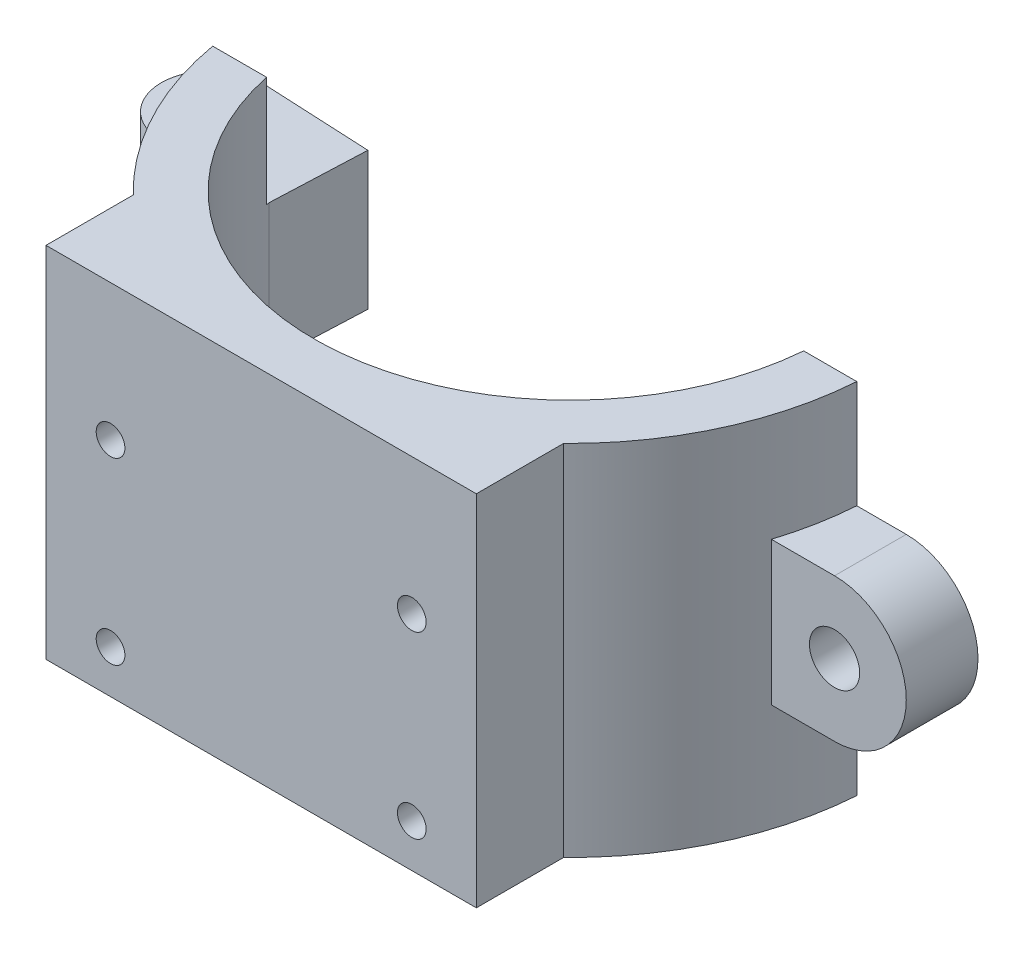
ISO-10303-21;
HEADER;
FILE_DESCRIPTION(('STEP AP214'),'2;1');
FILE_NAME('part.step','',(''),(''),'','','');
FILE_SCHEMA(('AUTOMOTIVE_DESIGN { 1 0 10303 214 1 1 1 1 }'));
ENDSEC;
DATA;
#1=APPLICATION_CONTEXT('core data for automotive mechanical design processes');
#2=APPLICATION_PROTOCOL_DEFINITION('international standard','automotive_design',2000,#1);
#3=PRODUCT_CONTEXT('',#1,'mechanical');
#4=PRODUCT('Part','Part','',(#3));
#5=PRODUCT_RELATED_PRODUCT_CATEGORY('part','',(#4));
#6=PRODUCT_DEFINITION_FORMATION('','',#4);
#7=PRODUCT_DEFINITION_CONTEXT('part definition',#1,'design');
#8=PRODUCT_DEFINITION('design','',#6,#7);
#9=PRODUCT_DEFINITION_SHAPE('','',#8);
#10=(LENGTH_UNIT() NAMED_UNIT(*) SI_UNIT(.MILLI.,.METRE.));
#11=(NAMED_UNIT(*) PLANE_ANGLE_UNIT() SI_UNIT($,.RADIAN.));
#12=(NAMED_UNIT(*) SI_UNIT($,.STERADIAN.) SOLID_ANGLE_UNIT());
#13=UNCERTAINTY_MEASURE_WITH_UNIT(LENGTH_MEASURE(1.E-05),#10,'distance_accuracy_value','');
#14=(GEOMETRIC_REPRESENTATION_CONTEXT(3) GLOBAL_UNCERTAINTY_ASSIGNED_CONTEXT((#13)) GLOBAL_UNIT_ASSIGNED_CONTEXT((#10,
#11,#12)) REPRESENTATION_CONTEXT('',''));
#15=CARTESIAN_POINT('',(0.,0.,0.));
#16=DIRECTION('',(0.,0.,1.));
#17=DIRECTION('',(1.,0.,0.));
#18=AXIS2_PLACEMENT_3D('',#15,#16,#17);
#19=CARTESIAN_POINT('',(0.,-72.1979747624781,1.5));
#20=DIRECTION('',(0.,1.,0.));
#21=DIRECTION('',(0.,0.,1.));
#22=AXIS2_PLACEMENT_3D('',#19,#20,#21);
#23=CYLINDRICAL_SURFACE('',#22,21.5363065542818);
#24=DIRECTION('',(0.,1.,0.));
#25=VECTOR('',#24,1.);
#26=CARTESIAN_POINT('',(15.,-72.1979747624781,16.9535594605256));
#27=LINE('',#26,#25);
#28=CARTESIAN_POINT('',(15.,-25.,16.9535594605256));
#29=VERTEX_POINT('',#28);
#30=CARTESIAN_POINT('',(15.,0.,16.9535594605256));
#31=VERTEX_POINT('',#30);
#32=EDGE_CURVE('E202',#29,#31,#27,.T.);
#33=ORIENTED_EDGE('',*,*,#32,.F.);
#34=CARTESIAN_POINT('',(0.,-25.,1.5));
#35=DIRECTION('',(0.,1.,0.));
#36=DIRECTION('',(0.,0.,1.));
#37=AXIS2_PLACEMENT_3D('',#34,#35,#36);
#38=CIRCLE('',#37,21.5363065542818);
#39=CARTESIAN_POINT('',(21.4840056786438,-25.,2.99999999999998));
#40=VERTEX_POINT('',#39);
#41=EDGE_CURVE('E286',#40,#29,#38,.F.);
#42=ORIENTED_EDGE('',*,*,#41,.F.);
#43=DIRECTION('',(0.,1.,0.));
#44=VECTOR('',#43,1.);
#45=CARTESIAN_POINT('',(21.4840056786438,-72.1979747624781,2.99999999999998));
#46=LINE('',#45,#44);
#47=CARTESIAN_POINT('',(21.4840056786438,-17.5,2.99999999999998));
#48=VERTEX_POINT('',#47);
#49=EDGE_CURVE('E304',#40,#48,#46,.T.);
#50=ORIENTED_EDGE('',*,*,#49,.T.);
#51=CARTESIAN_POINT('',(0.,-17.5,1.5));
#52=DIRECTION('',(0.,-1.,0.));
#53=DIRECTION('',(0.,0.,-1.));
#54=AXIS2_PLACEMENT_3D('',#51,#52,#53);
#55=CIRCLE('',#54,21.5363065542818);
#56=CARTESIAN_POINT('',(20.5319872394272,-17.5,7.99999999999999));
#57=VERTEX_POINT('',#56);
#58=EDGE_CURVE('E316',#57,#48,#55,.F.);
#59=ORIENTED_EDGE('',*,*,#58,.F.);
#60=DIRECTION('',(0.,1.,0.));
#61=VECTOR('',#60,1.);
#62=CARTESIAN_POINT('',(20.5319872394272,-72.1979747624781,7.99999999999999));
#63=LINE('',#62,#61);
#64=CARTESIAN_POINT('',(20.5319872394272,-7.50000000000001,7.99999999999999));
#65=VERTEX_POINT('',#64);
#66=EDGE_CURVE('E294',#65,#57,#63,.F.);
#67=ORIENTED_EDGE('',*,*,#66,.F.);
#68=CARTESIAN_POINT('',(0.,-7.50000000000001,1.5));
#69=DIRECTION('',(0.,1.,0.));
#70=DIRECTION('',(-1.,0.,0.));
#71=AXIS2_PLACEMENT_3D('',#68,#69,#70);
#72=CIRCLE('',#71,21.5363065542818);
#73=CARTESIAN_POINT('',(21.4840056786438,-7.5,2.99999999999999));
#74=VERTEX_POINT('',#73);
#75=EDGE_CURVE('E313',#74,#65,#72,.F.);
#76=ORIENTED_EDGE('',*,*,#75,.F.);
#77=CARTESIAN_POINT('',(21.4840056786438,0.,2.99999999999998));
#78=VERTEX_POINT('',#77);
#79=EDGE_CURVE('E306',#74,#78,#46,.T.);
#80=ORIENTED_EDGE('',*,*,#79,.T.);
#81=CARTESIAN_POINT('',(0.,0.,1.5));
#82=DIRECTION('',(0.,1.,0.));
#83=DIRECTION('',(0.,0.,1.));
#84=AXIS2_PLACEMENT_3D('',#81,#82,#83);
#85=CIRCLE('',#84,21.5363065542818);
#86=EDGE_CURVE('E296',#31,#78,#85,.T.);
#87=ORIENTED_EDGE('',*,*,#86,.F.);
#88=EDGE_LOOP('',(#33,#42,#50,#59,#67,#76,#80,#87));
#89=FACE_BOUND('',#88,.T.);
#90=ADVANCED_FACE('F33',(#89),#23,.T.);
#91=CARTESIAN_POINT('',(0.,-72.1979747624781,1.5));
#92=DIRECTION('',(0.,1.,0.));
#93=DIRECTION('',(0.,0.,1.));
#94=AXIS2_PLACEMENT_3D('',#91,#92,#93);
#95=CYLINDRICAL_SURFACE('',#94,17.8465682975747);
#96=DIRECTION('',(0.,1.,0.));
#97=VECTOR('',#96,1.);
#98=CARTESIAN_POINT('',(-17.4588086649691,-72.1979747624781,5.20000000000001));
#99=LINE('',#98,#97);
#100=CARTESIAN_POINT('',(-17.4588086649691,0.,5.20000000000001));
#101=VERTEX_POINT('',#100);
#102=CARTESIAN_POINT('',(-17.4588086649691,-7.7,5.20000000000001));
#103=VERTEX_POINT('',#102);
#104=EDGE_CURVE('E222',#101,#103,#99,.F.);
#105=ORIENTED_EDGE('',*,*,#104,.F.);
#106=CARTESIAN_POINT('',(0.,0.,1.5));
#107=DIRECTION('',(0.,-1.,0.));
#108=DIRECTION('',(0.,0.,1.));
#109=AXIS2_PLACEMENT_3D('',#106,#107,#108);
#110=CIRCLE('',#109,17.8465682975747);
#111=CARTESIAN_POINT('',(17.7834192437787,0.,2.99999999999999));
#112=VERTEX_POINT('',#111);
#113=EDGE_CURVE('E285',#112,#101,#110,.T.);
#114=ORIENTED_EDGE('',*,*,#113,.F.);
#115=DIRECTION('',(0.,1.,0.));
#116=VECTOR('',#115,1.);
#117=CARTESIAN_POINT('',(17.7834192437787,-72.1979747624781,2.99999999999999));
#118=LINE('',#117,#116);
#119=CARTESIAN_POINT('',(17.7834192437787,-25.,2.99999999999999));
#120=VERTEX_POINT('',#119);
#121=EDGE_CURVE('E302',#120,#112,#118,.T.);
#122=ORIENTED_EDGE('',*,*,#121,.F.);
#123=CARTESIAN_POINT('',(0.,-25.,1.5));
#124=DIRECTION('',(0.,1.,0.));
#125=DIRECTION('',(0.,0.,1.));
#126=AXIS2_PLACEMENT_3D('',#123,#124,#125);
#127=CIRCLE('',#126,17.8465682975747);
#128=CARTESIAN_POINT('',(-17.4588086649691,-25.,5.20000000000001));
#129=VERTEX_POINT('',#128);
#130=EDGE_CURVE('E292',#129,#120,#127,.T.);
#131=ORIENTED_EDGE('',*,*,#130,.F.);
#132=DIRECTION('',(0.,1.,0.));
#133=VECTOR('',#132,1.);
#134=CARTESIAN_POINT('',(-17.4588086649691,-72.1979747624781,5.20000000000001));
#135=LINE('',#134,#133);
#136=CARTESIAN_POINT('',(-17.4588086649691,-17.3,5.20000000000001));
#137=VERTEX_POINT('',#136);
#138=EDGE_CURVE('E48',#137,#129,#135,.F.);
#139=ORIENTED_EDGE('',*,*,#138,.F.);
#140=CARTESIAN_POINT('',(0.,-17.3,1.5));
#141=DIRECTION('',(0.,1.,0.));
#142=DIRECTION('',(0.,0.,1.));
#143=AXIS2_PLACEMENT_3D('',#140,#141,#142);
#144=CIRCLE('',#143,17.8465682975747);
#145=CARTESIAN_POINT('',(-17.5,-17.3,5.00000000000001));
#146=VERTEX_POINT('',#145);
#147=EDGE_CURVE('E207',#146,#137,#144,.T.);
#148=ORIENTED_EDGE('',*,*,#147,.F.);
#149=DIRECTION('',(0.,-1.,0.));
#150=VECTOR('',#149,1.);
#151=CARTESIAN_POINT('',(-17.5,-7.7,5.00000000000001));
#152=LINE('',#151,#150);
#153=CARTESIAN_POINT('',(-17.5,-7.7,5.00000000000001));
#154=VERTEX_POINT('',#153);
#155=EDGE_CURVE('E273',#154,#146,#152,.T.);
#156=ORIENTED_EDGE('',*,*,#155,.F.);
#157=CARTESIAN_POINT('',(0.,-7.7,1.5));
#158=DIRECTION('',(0.,-1.,0.));
#159=DIRECTION('',(0.,0.,-1.));
#160=AXIS2_PLACEMENT_3D('',#157,#158,#159);
#161=CIRCLE('',#160,17.8465682975747);
#162=EDGE_CURVE('E219',#103,#154,#161,.T.);
#163=ORIENTED_EDGE('',*,*,#162,.F.);
#164=EDGE_LOOP('',(#105,#114,#122,#131,#139,#148,#156,#163));
#165=FACE_BOUND('',#164,.T.);
#166=ADVANCED_FACE('F35',(#165),#95,.F.);
#167=CARTESIAN_POINT('',(17.7834192437787,-72.1979747624781,2.99999999999999));
#168=DIRECTION('',(0.,0.,-1.));
#169=DIRECTION('',(-1.,0.,0.));
#170=AXIS2_PLACEMENT_3D('',#167,#168,#169);
#171=PLANE('',#170);
#172=ORIENTED_EDGE('',*,*,#79,.F.);
#173=DIRECTION('',(1.,0.,0.));
#174=VECTOR('',#173,1.);
#175=CARTESIAN_POINT('',(17.7834192437787,-7.5,2.99999999999999));
#176=LINE('',#175,#174);
#177=CARTESIAN_POINT('',(24.9355957741627,-7.5,2.99999999999999));
#178=VERTEX_POINT('',#177);
#179=EDGE_CURVE('E228',#74,#178,#176,.T.);
#180=ORIENTED_EDGE('',*,*,#179,.T.);
#181=CARTESIAN_POINT('',(24.9355957741627,-12.5,2.99999999999999));
#182=DIRECTION('',(0.,0.,-1.));
#183=DIRECTION('',(1.,0.,0.));
#184=AXIS2_PLACEMENT_3D('',#181,#182,#183);
#185=CIRCLE('',#184,5.);
#186=CARTESIAN_POINT('',(24.9355957741627,-17.5,2.99999999999999));
#187=VERTEX_POINT('',#186);
#188=EDGE_CURVE('E242',#178,#187,#185,.T.);
#189=ORIENTED_EDGE('',*,*,#188,.T.);
#190=DIRECTION('',(-1.,0.,0.));
#191=VECTOR('',#190,1.);
#192=CARTESIAN_POINT('',(17.7834192437787,-17.5,2.99999999999999));
#193=LINE('',#192,#191);
#194=EDGE_CURVE('E234',#187,#48,#193,.T.);
#195=ORIENTED_EDGE('',*,*,#194,.T.);
#196=ORIENTED_EDGE('',*,*,#49,.F.);
#197=DIRECTION('',(1.,0.,0.));
#198=VECTOR('',#197,1.);
#199=CARTESIAN_POINT('',(17.7834192437787,-25.,2.99999999999999));
#200=LINE('',#199,#198);
#201=EDGE_CURVE('E289',#120,#40,#200,.T.);
#202=ORIENTED_EDGE('',*,*,#201,.F.);
#203=ORIENTED_EDGE('',*,*,#121,.T.);
#204=DIRECTION('',(-1.,0.,0.));
#205=VECTOR('',#204,1.);
#206=CARTESIAN_POINT('',(17.7834192437787,0.,2.99999999999999));
#207=LINE('',#206,#205);
#208=EDGE_CURVE('E298',#78,#112,#207,.T.);
#209=ORIENTED_EDGE('',*,*,#208,.F.);
#210=EDGE_LOOP('',(#172,#180,#189,#195,#196,#202,#203,#209));
#211=FACE_BOUND('',#210,.T.);
#212=CARTESIAN_POINT('',(24.9355957741627,-12.5,2.99999999999999));
#213=DIRECTION('',(0.,0.,-1.));
#214=DIRECTION('',(-1.,0.,0.));
#215=AXIS2_PLACEMENT_3D('',#212,#213,#214);
#216=CIRCLE('',#215,1.75);
#217=CARTESIAN_POINT('',(23.1855957741627,-12.5,2.99999999999999));
#218=VERTEX_POINT('',#217);
#219=EDGE_CURVE('E224',#218,#218,#216,.T.);
#220=ORIENTED_EDGE('',*,*,#219,.F.);
#221=EDGE_LOOP('',(#220));
#222=FACE_BOUND('',#221,.T.);
#223=ADVANCED_FACE('F422',(#211,#222),#171,.T.);
#224=DIRECTION('',(0.,1.,0.));
#225=VECTOR('',#224,1.);
#226=CARTESIAN_POINT('',(-15.,-72.1979747624781,16.9535594605256));
#227=LINE('',#226,#225);
#228=CARTESIAN_POINT('',(-15.,0.,16.9535594605256));
#229=VERTEX_POINT('',#228);
#230=CARTESIAN_POINT('',(-15.,-25.,16.9535594605256));
#231=VERTEX_POINT('',#230);
#232=EDGE_CURVE('E199',#229,#231,#227,.F.);
#233=ORIENTED_EDGE('',*,*,#232,.F.);
#234=CARTESIAN_POINT('',(-21.2160905918126,0.,5.20000000000001));
#235=VERTEX_POINT('',#234);
#236=EDGE_CURVE('E174',#235,#229,#85,.T.);
#237=ORIENTED_EDGE('',*,*,#236,.F.);
#238=DIRECTION('',(0.,1.,0.));
#239=VECTOR('',#238,1.);
#240=CARTESIAN_POINT('',(-21.2160905918126,-72.1979747624781,5.20000000000001));
#241=LINE('',#240,#239);
#242=CARTESIAN_POINT('',(-21.2160905918126,-7.7,5.20000000000001));
#243=VERTEX_POINT('',#242);
#244=EDGE_CURVE('E55',#243,#235,#241,.T.);
#245=ORIENTED_EDGE('',*,*,#244,.F.);
#246=CARTESIAN_POINT('',(0.,-7.7,1.5));
#247=DIRECTION('',(0.,-1.,0.));
#248=DIRECTION('',(0.,0.,-1.));
#249=AXIS2_PLACEMENT_3D('',#246,#247,#248);
#250=CIRCLE('',#249,21.5363065542818);
#251=CARTESIAN_POINT('',(-21.25,-7.7,5.00000000000001));
#252=VERTEX_POINT('',#251);
#253=EDGE_CURVE('E217',#252,#243,#250,.F.);
#254=ORIENTED_EDGE('',*,*,#253,.F.);
#255=DIRECTION('',(0.,1.,0.));
#256=VECTOR('',#255,1.);
#257=CARTESIAN_POINT('',(-21.25,-72.1979747624781,5.00000000000001));
#258=LINE('',#257,#256);
#259=CARTESIAN_POINT('',(-21.25,-17.3,5.00000000000001));
#260=VERTEX_POINT('',#259);
#261=EDGE_CURVE('E301',#260,#252,#258,.T.);
#262=ORIENTED_EDGE('',*,*,#261,.F.);
#263=CARTESIAN_POINT('',(0.,-17.3,1.5));
#264=DIRECTION('',(0.,1.,0.));
#265=DIRECTION('',(0.,0.,1.));
#266=AXIS2_PLACEMENT_3D('',#263,#264,#265);
#267=CIRCLE('',#266,21.5363065542818);
#268=CARTESIAN_POINT('',(-21.2160905918126,-17.3,5.20000000000001));
#269=VERTEX_POINT('',#268);
#270=EDGE_CURVE('E209',#269,#260,#267,.F.);
#271=ORIENTED_EDGE('',*,*,#270,.F.);
#272=DIRECTION('',(0.,1.,0.));
#273=VECTOR('',#272,1.);
#274=CARTESIAN_POINT('',(-21.2160905918126,-72.1979747624781,5.20000000000001));
#275=LINE('',#274,#273);
#276=CARTESIAN_POINT('',(-21.2160905918126,-25.,5.20000000000001));
#277=VERTEX_POINT('',#276);
#278=EDGE_CURVE('E211',#277,#269,#275,.T.);
#279=ORIENTED_EDGE('',*,*,#278,.F.);
#280=EDGE_CURVE('E290',#231,#277,#38,.F.);
#281=ORIENTED_EDGE('',*,*,#280,.F.);
#282=EDGE_LOOP('',(#233,#237,#245,#254,#262,#271,#279,#281));
#283=FACE_BOUND('',#282,.T.);
#284=ADVANCED_FACE('F350',(#283),#23,.T.);
#285=CARTESIAN_POINT('',(0.,0.,1.5));
#286=DIRECTION('',(0.,1.,0.));
#287=DIRECTION('',(0.,0.,1.));
#288=AXIS2_PLACEMENT_3D('',#285,#286,#287);
#289=PLANE('',#288);
#290=ORIENTED_EDGE('',*,*,#236,.T.);
#291=DIRECTION('',(0.,0.,1.));
#292=VECTOR('',#291,1.);
#293=CARTESIAN_POINT('',(-15.,0.,11.1695398029069));
#294=LINE('',#293,#292);
#295=CARTESIAN_POINT('',(-15.,0.,23.0363065542818));
#296=VERTEX_POINT('',#295);
#297=EDGE_CURVE('E166',#229,#296,#294,.T.);
#298=ORIENTED_EDGE('',*,*,#297,.T.);
#299=DIRECTION('',(1.,0.,0.));
#300=VECTOR('',#299,1.);
#301=CARTESIAN_POINT('',(15.,0.,23.0363065542818));
#302=LINE('',#301,#300);
#303=CARTESIAN_POINT('',(15.,0.,23.0363065542818));
#304=VERTEX_POINT('',#303);
#305=EDGE_CURVE('E171',#296,#304,#302,.T.);
#306=ORIENTED_EDGE('',*,*,#305,.T.);
#307=DIRECTION('',(0.,0.,-1.));
#308=VECTOR('',#307,1.);
#309=CARTESIAN_POINT('',(15.,0.,11.1695398029069));
#310=LINE('',#309,#308);
#311=EDGE_CURVE('E187',#304,#31,#310,.T.);
#312=ORIENTED_EDGE('',*,*,#311,.T.);
#313=ORIENTED_EDGE('',*,*,#86,.T.);
#314=ORIENTED_EDGE('',*,*,#208,.T.);
#315=ORIENTED_EDGE('',*,*,#113,.T.);
#316=DIRECTION('',(1.,0.,0.));
#317=VECTOR('',#316,1.);
#318=CARTESIAN_POINT('',(0.,0.,5.20000000000001));
#319=LINE('',#318,#317);
#320=EDGE_CURVE('E41',#235,#101,#319,.T.);
#321=ORIENTED_EDGE('',*,*,#320,.F.);
#322=EDGE_LOOP('',(#290,#298,#306,#312,#313,#314,#315,#321));
#323=FACE_BOUND('',#322,.T.);
#324=ADVANCED_FACE('F168',(#323),#289,.T.);
#325=CARTESIAN_POINT('',(0.,-25.,1.5));
#326=DIRECTION('',(0.,1.,0.));
#327=DIRECTION('',(1.,0.,0.));
#328=AXIS2_PLACEMENT_3D('',#325,#326,#327);
#329=PLANE('',#328);
#330=ORIENTED_EDGE('',*,*,#130,.T.);
#331=ORIENTED_EDGE('',*,*,#201,.T.);
#332=ORIENTED_EDGE('',*,*,#41,.T.);
#333=DIRECTION('',(0.,0.,1.));
#334=VECTOR('',#333,1.);
#335=CARTESIAN_POINT('',(15.,-25.,11.1695398029069));
#336=LINE('',#335,#334);
#337=CARTESIAN_POINT('',(15.,-25.,23.0363065542818));
#338=VERTEX_POINT('',#337);
#339=EDGE_CURVE('E200',#29,#338,#336,.T.);
#340=ORIENTED_EDGE('',*,*,#339,.T.);
#341=DIRECTION('',(-1.,0.,0.));
#342=VECTOR('',#341,1.);
#343=CARTESIAN_POINT('',(15.,-25.,23.0363065542818));
#344=LINE('',#343,#342);
#345=CARTESIAN_POINT('',(-15.,-25.,23.0363065542818));
#346=VERTEX_POINT('',#345);
#347=EDGE_CURVE('E196',#338,#346,#344,.T.);
#348=ORIENTED_EDGE('',*,*,#347,.T.);
#349=DIRECTION('',(0.,0.,-1.));
#350=VECTOR('',#349,1.);
#351=CARTESIAN_POINT('',(-15.,-25.,11.1695398029069));
#352=LINE('',#351,#350);
#353=EDGE_CURVE('E184',#346,#231,#352,.T.);
#354=ORIENTED_EDGE('',*,*,#353,.T.);
#355=ORIENTED_EDGE('',*,*,#280,.T.);
#356=DIRECTION('',(1.,0.,0.));
#357=VECTOR('',#356,1.);
#358=CARTESIAN_POINT('',(0.,-25.,5.20000000000001));
#359=LINE('',#358,#357);
#360=EDGE_CURVE('E11',#277,#129,#359,.T.);
#361=ORIENTED_EDGE('',*,*,#360,.T.);
#362=EDGE_LOOP('',(#330,#331,#332,#340,#348,#354,#355,#361));
#363=FACE_BOUND('',#362,.T.);
#364=ADVANCED_FACE('F354',(#363),#329,.F.);
#365=CARTESIAN_POINT('',(-25.,-7.7,1.50000000000001));
#366=DIRECTION('',(0.,-1.,0.));
#367=DIRECTION('',(0.,0.,-1.));
#368=AXIS2_PLACEMENT_3D('',#365,#366,#367);
#369=PLANE('',#368);
#370=DIRECTION('',(0.0423319231284847,0.,-0.999103602377773));
#371=VECTOR('',#370,1.);
#372=CARTESIAN_POINT('',(-17.5,-7.7,5.00000000000001));
#373=LINE('',#372,#371);
#374=CARTESIAN_POINT('',(-17.2194755062737,-7.7,-1.62084336179157));
#375=VERTEX_POINT('',#374);
#376=EDGE_CURVE('E265',#154,#375,#373,.T.);
#377=ORIENTED_EDGE('',*,*,#376,.T.);
#378=DIRECTION('',(-0.99881473102752,0.,-0.0486737412001986));
#379=VECTOR('',#378,1.);
#380=CARTESIAN_POINT('',(-17.2194755062737,-7.7,-1.62084336179157));
#381=LINE('',#380,#379);
#382=CARTESIAN_POINT('',(-25.,-7.7,-1.99999999999999));
#383=VERTEX_POINT('',#382);
#384=EDGE_CURVE('E267',#375,#383,#381,.T.);
#385=ORIENTED_EDGE('',*,*,#384,.T.);
#386=CARTESIAN_POINT('',(-25.,-7.7,1.50000000000001));
#387=DIRECTION('',(0.,1.,0.));
#388=DIRECTION('',(0.,0.,-1.));
#389=AXIS2_PLACEMENT_3D('',#386,#387,#388);
#390=CIRCLE('',#389,3.5);
#391=CARTESIAN_POINT('',(-25.,-7.7,5.00000000000001));
#392=VERTEX_POINT('',#391);
#393=EDGE_CURVE('E269',#383,#392,#390,.T.);
#394=ORIENTED_EDGE('',*,*,#393,.T.);
#395=DIRECTION('',(1.,0.,0.));
#396=VECTOR('',#395,1.);
#397=CARTESIAN_POINT('',(-17.5,-7.7,5.00000000000001));
#398=LINE('',#397,#396);
#399=EDGE_CURVE('E271',#392,#252,#398,.T.);
#400=ORIENTED_EDGE('',*,*,#399,.T.);
#401=ORIENTED_EDGE('',*,*,#253,.T.);
#402=DIRECTION('',(1.,0.,0.));
#403=VECTOR('',#402,1.);
#404=CARTESIAN_POINT('',(-23.5437576545081,-7.7,5.20000000000001));
#405=LINE('',#404,#403);
#406=EDGE_CURVE('E214',#243,#103,#405,.T.);
#407=ORIENTED_EDGE('',*,*,#406,.T.);
#408=ORIENTED_EDGE('',*,*,#162,.T.);
#409=EDGE_LOOP('',(#377,#385,#394,#400,#401,#407,#408));
#410=FACE_BOUND('',#409,.T.);
#411=CARTESIAN_POINT('',(-25.,-7.7,1.50000000000001));
#412=DIRECTION('',(0.,1.,0.));
#413=DIRECTION('',(0.,0.,1.));
#414=AXIS2_PLACEMENT_3D('',#411,#412,#413);
#415=CIRCLE('',#414,1.5);
#416=CARTESIAN_POINT('',(-25.,-7.7,3.00000000000001));
#417=VERTEX_POINT('',#416);
#418=EDGE_CURVE('E262',#417,#417,#415,.T.);
#419=ORIENTED_EDGE('',*,*,#418,.F.);
#420=EDGE_LOOP('',(#419));
#421=FACE_BOUND('',#420,.T.);
#422=ADVANCED_FACE('F327',(#410,#421),#369,.F.);
#423=CARTESIAN_POINT('',(-17.5,-7.7,5.00000000000001));
#424=DIRECTION('',(-0.999103602377773,0.,-0.0423319231284847));
#425=DIRECTION('',(-0.0423319231284847,0.,0.999103602377774));
#426=AXIS2_PLACEMENT_3D('',#423,#424,#425);
#427=PLANE('',#426);
#428=ORIENTED_EDGE('',*,*,#155,.T.);
#429=DIRECTION('',(0.0423319231284847,0.,-0.999103602377774));
#430=VECTOR('',#429,1.);
#431=CARTESIAN_POINT('',(-17.5,-17.3,5.00000000000001));
#432=LINE('',#431,#430);
#433=CARTESIAN_POINT('',(-17.2194755062737,-17.3,-1.62084336179157));
#434=VERTEX_POINT('',#433);
#435=EDGE_CURVE('E260',#146,#434,#432,.T.);
#436=ORIENTED_EDGE('',*,*,#435,.T.);
#437=DIRECTION('',(0.,-1.,0.));
#438=VECTOR('',#437,1.);
#439=CARTESIAN_POINT('',(-17.2194755062737,-7.7,-1.62084336179157));
#440=LINE('',#439,#438);
#441=EDGE_CURVE('E282',#375,#434,#440,.T.);
#442=ORIENTED_EDGE('',*,*,#441,.F.);
#443=ORIENTED_EDGE('',*,*,#376,.F.);
#444=EDGE_LOOP('',(#428,#436,#442,#443));
#445=FACE_BOUND('',#444,.T.);
#446=ADVANCED_FACE('F332',(#445),#427,.F.);
#447=CARTESIAN_POINT('',(-17.2194755062737,-7.7,-1.62084336179157));
#448=DIRECTION('',(-0.0486737412001986,0.,0.998814731027519));
#449=DIRECTION('',(0.99881473102752,0.,0.0486737412001987));
#450=AXIS2_PLACEMENT_3D('',#447,#448,#449);
#451=PLANE('',#450);
#452=ORIENTED_EDGE('',*,*,#441,.T.);
#453=DIRECTION('',(-0.99881473102752,0.,-0.0486737412001987));
#454=VECTOR('',#453,1.);
#455=CARTESIAN_POINT('',(-17.2194755062737,-17.3,-1.62084336179157));
#456=LINE('',#455,#454);
#457=CARTESIAN_POINT('',(-25.,-17.3,-1.99999999999999));
#458=VERTEX_POINT('',#457);
#459=EDGE_CURVE('E257',#434,#458,#456,.T.);
#460=ORIENTED_EDGE('',*,*,#459,.T.);
#461=DIRECTION('',(0.,-1.,0.));
#462=VECTOR('',#461,1.);
#463=CARTESIAN_POINT('',(-25.,-7.7,-1.99999999999999));
#464=LINE('',#463,#462);
#465=EDGE_CURVE('E279',#383,#458,#464,.T.);
#466=ORIENTED_EDGE('',*,*,#465,.F.);
#467=ORIENTED_EDGE('',*,*,#384,.F.);
#468=EDGE_LOOP('',(#452,#460,#466,#467));
#469=FACE_BOUND('',#468,.T.);
#470=ADVANCED_FACE('F336',(#469),#451,.F.);
#471=CARTESIAN_POINT('',(-25.,-7.7,1.50000000000001));
#472=DIRECTION('',(0.,-1.,0.));
#473=DIRECTION('',(0.,0.,-1.));
#474=AXIS2_PLACEMENT_3D('',#471,#472,#473);
#475=CYLINDRICAL_SURFACE('',#474,3.5);
#476=ORIENTED_EDGE('',*,*,#465,.T.);
#477=CARTESIAN_POINT('',(-25.,-17.3,1.50000000000001));
#478=DIRECTION('',(0.,1.,0.));
#479=DIRECTION('',(0.,0.,1.));
#480=AXIS2_PLACEMENT_3D('',#477,#478,#479);
#481=CIRCLE('',#480,3.5);
#482=CARTESIAN_POINT('',(-25.,-17.3,5.));
#483=VERTEX_POINT('',#482);
#484=EDGE_CURVE('E254',#458,#483,#481,.T.);
#485=ORIENTED_EDGE('',*,*,#484,.T.);
#486=DIRECTION('',(0.,-1.,0.));
#487=VECTOR('',#486,1.);
#488=CARTESIAN_POINT('',(-25.,-7.7,5.00000000000001));
#489=LINE('',#488,#487);
#490=EDGE_CURVE('E276',#392,#483,#489,.T.);
#491=ORIENTED_EDGE('',*,*,#490,.F.);
#492=ORIENTED_EDGE('',*,*,#393,.F.);
#493=EDGE_LOOP('',(#476,#485,#491,#492));
#494=FACE_BOUND('',#493,.T.);
#495=ADVANCED_FACE('F343',(#494),#475,.T.);
#496=CARTESIAN_POINT('',(-17.5,-7.7,5.00000000000001));
#497=DIRECTION('',(0.,0.,-1.));
#498=DIRECTION('',(-1.,0.,0.));
#499=AXIS2_PLACEMENT_3D('',#496,#497,#498);
#500=PLANE('',#499);
#501=ORIENTED_EDGE('',*,*,#490,.T.);
#502=DIRECTION('',(-1.,0.,0.));
#503=VECTOR('',#502,1.);
#504=CARTESIAN_POINT('',(-10.6949369199469,-17.3,5.00000000000001));
#505=LINE('',#504,#503);
#506=EDGE_CURVE('E249',#260,#483,#505,.T.);
#507=ORIENTED_EDGE('',*,*,#506,.F.);
#508=ORIENTED_EDGE('',*,*,#261,.T.);
#509=ORIENTED_EDGE('',*,*,#399,.F.);
#510=EDGE_LOOP('',(#501,#507,#508,#509));
#511=FACE_BOUND('',#510,.T.);
#512=ADVANCED_FACE('F346',(#511),#500,.F.);
#513=CARTESIAN_POINT('',(-25.,-7.7,1.50000000000001));
#514=DIRECTION('',(0.,-1.,0.));
#515=DIRECTION('',(0.,0.,-1.));
#516=AXIS2_PLACEMENT_3D('',#513,#514,#515);
#517=CYLINDRICAL_SURFACE('',#516,1.5);
#518=CARTESIAN_POINT('',(-25.,-17.3,1.50000000000001));
#519=DIRECTION('',(0.,1.,0.));
#520=DIRECTION('',(0.,0.,1.));
#521=AXIS2_PLACEMENT_3D('',#518,#519,#520);
#522=CIRCLE('',#521,1.5);
#523=CARTESIAN_POINT('',(-25.,-17.3,3.00000000000001));
#524=VERTEX_POINT('',#523);
#525=EDGE_CURVE('E253',#524,#524,#522,.T.);
#526=ORIENTED_EDGE('',*,*,#525,.F.);
#527=EDGE_LOOP('',(#526));
#528=FACE_BOUND('',#527,.T.);
#529=ORIENTED_EDGE('',*,*,#418,.T.);
#530=EDGE_LOOP('',(#529));
#531=FACE_BOUND('',#530,.T.);
#532=ADVANCED_FACE('F446',(#528,#531),#517,.F.);
#533=CARTESIAN_POINT('',(0.,-17.3,0.));
#534=DIRECTION('',(0.,1.,0.));
#535=DIRECTION('',(0.,0.,1.));
#536=AXIS2_PLACEMENT_3D('',#533,#534,#535);
#537=PLANE('',#536);
#538=ORIENTED_EDGE('',*,*,#506,.T.);
#539=ORIENTED_EDGE('',*,*,#484,.F.);
#540=ORIENTED_EDGE('',*,*,#459,.F.);
#541=ORIENTED_EDGE('',*,*,#435,.F.);
#542=ORIENTED_EDGE('',*,*,#147,.T.);
#543=DIRECTION('',(-1.,0.,0.));
#544=VECTOR('',#543,1.);
#545=CARTESIAN_POINT('',(-15.1624284329301,-17.3,5.20000000000001));
#546=LINE('',#545,#544);
#547=EDGE_CURVE('E204',#137,#269,#546,.T.);
#548=ORIENTED_EDGE('',*,*,#547,.T.);
#549=ORIENTED_EDGE('',*,*,#270,.T.);
#550=EDGE_LOOP('',(#538,#539,#540,#541,#542,#548,#549));
#551=FACE_BOUND('',#550,.T.);
#552=ORIENTED_EDGE('',*,*,#525,.T.);
#553=EDGE_LOOP('',(#552));
#554=FACE_BOUND('',#553,.T.);
#555=ADVANCED_FACE('F451',(#551,#554),#537,.F.);
#556=CARTESIAN_POINT('',(17.7834192437787,-17.5,7.99999999999999));
#557=DIRECTION('',(0.,-1.,0.));
#558=DIRECTION('',(0.,0.,-1.));
#559=AXIS2_PLACEMENT_3D('',#556,#557,#558);
#560=PLANE('',#559);
#561=DIRECTION('',(-1.,0.,0.));
#562=VECTOR('',#561,1.);
#563=CARTESIAN_POINT('',(17.7834192437787,-17.5,7.99999999999999));
#564=LINE('',#563,#562);
#565=CARTESIAN_POINT('',(24.9355957741627,-17.5,7.99999999999999));
#566=VERTEX_POINT('',#565);
#567=EDGE_CURVE('E237',#566,#57,#564,.T.);
#568=ORIENTED_EDGE('',*,*,#567,.T.);
#569=ORIENTED_EDGE('',*,*,#58,.T.);
#570=ORIENTED_EDGE('',*,*,#194,.F.);
#571=DIRECTION('',(0.,0.,-1.));
#572=VECTOR('',#571,1.);
#573=CARTESIAN_POINT('',(24.9355957741627,-17.5,7.99999999999999));
#574=LINE('',#573,#572);
#575=EDGE_CURVE('E247',#566,#187,#574,.T.);
#576=ORIENTED_EDGE('',*,*,#575,.F.);
#577=EDGE_LOOP('',(#568,#569,#570,#576));
#578=FACE_BOUND('',#577,.T.);
#579=ADVANCED_FACE('F455',(#578),#560,.T.);
#580=CARTESIAN_POINT('',(24.9355957741627,-12.5,7.99999999999999));
#581=DIRECTION('',(0.,0.,-1.));
#582=DIRECTION('',(-1.,0.,0.));
#583=AXIS2_PLACEMENT_3D('',#580,#581,#582);
#584=CYLINDRICAL_SURFACE('',#583,5.);
#585=ORIENTED_EDGE('',*,*,#188,.F.);
#586=DIRECTION('',(0.,0.,-1.));
#587=VECTOR('',#586,1.);
#588=CARTESIAN_POINT('',(24.9355957741627,-7.5,7.99999999999999));
#589=LINE('',#588,#587);
#590=CARTESIAN_POINT('',(24.9355957741627,-7.5,7.99999999999999));
#591=VERTEX_POINT('',#590);
#592=EDGE_CURVE('E240',#591,#178,#589,.T.);
#593=ORIENTED_EDGE('',*,*,#592,.F.);
#594=CARTESIAN_POINT('',(24.9355957741627,-12.5,7.99999999999999));
#595=DIRECTION('',(0.,0.,-1.));
#596=DIRECTION('',(1.,0.,0.));
#597=AXIS2_PLACEMENT_3D('',#594,#595,#596);
#598=CIRCLE('',#597,5.);
#599=EDGE_CURVE('E233',#591,#566,#598,.T.);
#600=ORIENTED_EDGE('',*,*,#599,.T.);
#601=ORIENTED_EDGE('',*,*,#575,.T.);
#602=EDGE_LOOP('',(#585,#593,#600,#601));
#603=FACE_BOUND('',#602,.T.);
#604=ADVANCED_FACE('F461',(#603),#584,.T.);
#605=CARTESIAN_POINT('',(17.7834192437787,-7.5,7.99999999999999));
#606=DIRECTION('',(0.,1.,0.));
#607=DIRECTION('',(-1.,0.,0.));
#608=AXIS2_PLACEMENT_3D('',#605,#606,#607);
#609=PLANE('',#608);
#610=ORIENTED_EDGE('',*,*,#179,.F.);
#611=ORIENTED_EDGE('',*,*,#75,.T.);
#612=DIRECTION('',(1.,0.,0.));
#613=VECTOR('',#612,1.);
#614=CARTESIAN_POINT('',(17.7834192437787,-7.5,7.99999999999999));
#615=LINE('',#614,#613);
#616=EDGE_CURVE('E231',#65,#591,#615,.T.);
#617=ORIENTED_EDGE('',*,*,#616,.T.);
#618=ORIENTED_EDGE('',*,*,#592,.T.);
#619=EDGE_LOOP('',(#610,#611,#617,#618));
#620=FACE_BOUND('',#619,.T.);
#621=ADVANCED_FACE('F457',(#620),#609,.T.);
#622=CARTESIAN_POINT('',(24.9355957741627,-12.5,7.99999999999999));
#623=DIRECTION('',(0.,0.,1.));
#624=DIRECTION('',(1.,0.,0.));
#625=AXIS2_PLACEMENT_3D('',#622,#623,#624);
#626=PLANE('',#625);
#627=CARTESIAN_POINT('',(24.9355957741627,-12.5,7.99999999999999));
#628=DIRECTION('',(0.,0.,-1.));
#629=DIRECTION('',(-1.,0.,0.));
#630=AXIS2_PLACEMENT_3D('',#627,#628,#629);
#631=CIRCLE('',#630,1.75);
#632=CARTESIAN_POINT('',(23.1855957741627,-12.5,7.99999999999999));
#633=VERTEX_POINT('',#632);
#634=EDGE_CURVE('E225',#633,#633,#631,.T.);
#635=ORIENTED_EDGE('',*,*,#634,.T.);
#636=EDGE_LOOP('',(#635));
#637=FACE_BOUND('',#636,.T.);
#638=ORIENTED_EDGE('',*,*,#616,.F.);
#639=ORIENTED_EDGE('',*,*,#66,.T.);
#640=ORIENTED_EDGE('',*,*,#567,.F.);
#641=ORIENTED_EDGE('',*,*,#599,.F.);
#642=EDGE_LOOP('',(#638,#639,#640,#641));
#643=FACE_BOUND('',#642,.T.);
#644=ADVANCED_FACE('F460',(#637,#643),#626,.T.);
#645=CARTESIAN_POINT('',(24.9355957741627,-12.5,7.99999999999999));
#646=DIRECTION('',(0.,0.,-1.));
#647=DIRECTION('',(-1.,0.,0.));
#648=AXIS2_PLACEMENT_3D('',#645,#646,#647);
#649=CYLINDRICAL_SURFACE('',#648,1.75);
#650=ORIENTED_EDGE('',*,*,#634,.F.);
#651=EDGE_LOOP('',(#650));
#652=FACE_BOUND('',#651,.T.);
#653=ORIENTED_EDGE('',*,*,#219,.T.);
#654=EDGE_LOOP('',(#653));
#655=FACE_BOUND('',#654,.T.);
#656=ADVANCED_FACE('F471',(#652,#655),#649,.F.);
#657=CARTESIAN_POINT('',(-23.5437576545081,-23.088359803748,5.20000000000001));
#658=DIRECTION('',(0.,0.,1.));
#659=DIRECTION('',(1.,0.,0.));
#660=AXIS2_PLACEMENT_3D('',#657,#658,#659);
#661=PLANE('',#660);
#662=ORIENTED_EDGE('',*,*,#104,.T.);
#663=ORIENTED_EDGE('',*,*,#406,.F.);
#664=ORIENTED_EDGE('',*,*,#244,.T.);
#665=ORIENTED_EDGE('',*,*,#320,.T.);
#666=EDGE_LOOP('',(#662,#663,#664,#665));
#667=FACE_BOUND('',#666,.T.);
#668=ADVANCED_FACE('F319',(#667),#661,.F.);
#669=CARTESIAN_POINT('',(-15.1624284329301,-8.62598411136108,5.20000000000001));
#670=DIRECTION('',(0.,0.,1.));
#671=DIRECTION('',(1.,0.,0.));
#672=AXIS2_PLACEMENT_3D('',#669,#670,#671);
#673=PLANE('',#672);
#674=ORIENTED_EDGE('',*,*,#138,.T.);
#675=ORIENTED_EDGE('',*,*,#360,.F.);
#676=ORIENTED_EDGE('',*,*,#278,.T.);
#677=ORIENTED_EDGE('',*,*,#547,.F.);
#678=EDGE_LOOP('',(#674,#675,#676,#677));
#679=FACE_BOUND('',#678,.T.);
#680=ADVANCED_FACE('F394',(#679),#673,.F.);
#681=CARTESIAN_POINT('',(15.,-57.2617444217069,23.0363065542818));
#682=DIRECTION('',(0.,0.,1.));
#683=DIRECTION('',(1.,0.,0.));
#684=AXIS2_PLACEMENT_3D('',#681,#682,#683);
#685=PLANE('',#684);
#686=CARTESIAN_POINT('',(-10.5,-22.,23.0363065542818));
#687=DIRECTION('',(0.,0.,1.));
#688=DIRECTION('',(1.,0.,0.));
#689=AXIS2_PLACEMENT_3D('',#686,#687,#688);
#690=CIRCLE('',#689,1.);
#691=CARTESIAN_POINT('',(-9.49999999999999,-22.,23.0363065542818));
#692=VERTEX_POINT('',#691);
#693=EDGE_CURVE('E376',#692,#692,#690,.T.);
#694=ORIENTED_EDGE('',*,*,#693,.F.);
#695=EDGE_LOOP('',(#694));
#696=FACE_BOUND('',#695,.T.);
#697=CARTESIAN_POINT('',(10.5,-9.50000000000001,23.0363065542818));
#698=DIRECTION('',(0.,0.,1.));
#699=DIRECTION('',(1.,0.,0.));
#700=AXIS2_PLACEMENT_3D('',#697,#698,#699);
#701=CIRCLE('',#700,0.999999999999999);
#702=CARTESIAN_POINT('',(11.5,-9.50000000000001,23.0363065542818));
#703=VERTEX_POINT('',#702);
#704=EDGE_CURVE('E370',#703,#703,#701,.T.);
#705=ORIENTED_EDGE('',*,*,#704,.F.);
#706=EDGE_LOOP('',(#705));
#707=FACE_BOUND('',#706,.T.);
#708=CARTESIAN_POINT('',(-10.5,-9.50000000000001,23.0363065542818));
#709=DIRECTION('',(0.,0.,1.));
#710=DIRECTION('',(1.,0.,0.));
#711=AXIS2_PLACEMENT_3D('',#708,#709,#710);
#712=CIRCLE('',#711,0.999999999999999);
#713=CARTESIAN_POINT('',(-9.5,-9.50000000000001,23.0363065542818));
#714=VERTEX_POINT('',#713);
#715=EDGE_CURVE('E364',#714,#714,#712,.T.);
#716=ORIENTED_EDGE('',*,*,#715,.F.);
#717=EDGE_LOOP('',(#716));
#718=FACE_BOUND('',#717,.T.);
#719=CARTESIAN_POINT('',(10.5,-22.,23.0363065542818));
#720=DIRECTION('',(0.,0.,1.));
#721=DIRECTION('',(1.,0.,0.));
#722=AXIS2_PLACEMENT_3D('',#719,#720,#721);
#723=CIRCLE('',#722,1.);
#724=CARTESIAN_POINT('',(11.5,-22.,23.0363065542818));
#725=VERTEX_POINT('',#724);
#726=EDGE_CURVE('E358',#725,#725,#723,.T.);
#727=ORIENTED_EDGE('',*,*,#726,.F.);
#728=EDGE_LOOP('',(#727));
#729=FACE_BOUND('',#728,.T.);
#730=ORIENTED_EDGE('',*,*,#347,.F.);
#731=DIRECTION('',(0.,1.,0.));
#732=VECTOR('',#731,1.);
#733=CARTESIAN_POINT('',(15.,-57.2617444217069,23.0363065542818));
#734=LINE('',#733,#732);
#735=EDGE_CURVE('E186',#338,#304,#734,.T.);
#736=ORIENTED_EDGE('',*,*,#735,.T.);
#737=ORIENTED_EDGE('',*,*,#305,.F.);
#738=DIRECTION('',(0.,1.,0.));
#739=VECTOR('',#738,1.);
#740=CARTESIAN_POINT('',(-15.,-57.2617444217069,23.0363065542818));
#741=LINE('',#740,#739);
#742=EDGE_CURVE('E181',#346,#296,#741,.T.);
#743=ORIENTED_EDGE('',*,*,#742,.F.);
#744=EDGE_LOOP('',(#730,#736,#737,#743));
#745=FACE_BOUND('',#744,.T.);
#746=ADVANCED_FACE('F189',(#696,#707,#718,#729,#745),#685,.T.);
#747=CARTESIAN_POINT('',(15.,-57.2617444217069,11.1695398029069));
#748=DIRECTION('',(1.,0.,0.));
#749=DIRECTION('',(0.,0.,-1.));
#750=AXIS2_PLACEMENT_3D('',#747,#748,#749);
#751=PLANE('',#750);
#752=ORIENTED_EDGE('',*,*,#339,.F.);
#753=ORIENTED_EDGE('',*,*,#32,.T.);
#754=ORIENTED_EDGE('',*,*,#311,.F.);
#755=ORIENTED_EDGE('',*,*,#735,.F.);
#756=EDGE_LOOP('',(#752,#753,#754,#755));
#757=FACE_BOUND('',#756,.T.);
#758=ADVANCED_FACE('F393',(#757),#751,.T.);
#759=CARTESIAN_POINT('',(-15.,-57.2617444217069,11.1695398029069));
#760=DIRECTION('',(-1.,0.,0.));
#761=DIRECTION('',(0.,0.,1.));
#762=AXIS2_PLACEMENT_3D('',#759,#760,#761);
#763=PLANE('',#762);
#764=ORIENTED_EDGE('',*,*,#297,.F.);
#765=ORIENTED_EDGE('',*,*,#232,.T.);
#766=ORIENTED_EDGE('',*,*,#353,.F.);
#767=ORIENTED_EDGE('',*,*,#742,.T.);
#768=EDGE_LOOP('',(#764,#765,#766,#767));
#769=FACE_BOUND('',#768,.T.);
#770=ADVANCED_FACE('F182',(#769),#763,.T.);
#771=CARTESIAN_POINT('',(10.5,-22.,18.0363065542818));
#772=DIRECTION('',(0.,0.,1.));
#773=DIRECTION('',(1.,0.,0.));
#774=AXIS2_PLACEMENT_3D('',#771,#772,#773);
#775=CYLINDRICAL_SURFACE('',#774,1.);
#776=CARTESIAN_POINT('',(10.5,-22.,18.0363065542818));
#777=DIRECTION('',(0.,0.,1.));
#778=DIRECTION('',(1.,0.,0.));
#779=AXIS2_PLACEMENT_3D('',#776,#777,#778);
#780=CIRCLE('',#779,1.);
#781=CARTESIAN_POINT('',(11.5,-22.,18.0363065542818));
#782=VERTEX_POINT('',#781);
#783=EDGE_CURVE('E177',#782,#782,#780,.T.);
#784=ORIENTED_EDGE('',*,*,#783,.F.);
#785=EDGE_LOOP('',(#784));
#786=FACE_BOUND('',#785,.T.);
#787=ORIENTED_EDGE('',*,*,#726,.T.);
#788=EDGE_LOOP('',(#787));
#789=FACE_BOUND('',#788,.T.);
#790=ADVANCED_FACE('F402',(#786,#789),#775,.F.);
#791=CARTESIAN_POINT('',(10.5,-22.,18.0363065542818));
#792=DIRECTION('',(0.,0.,1.));
#793=DIRECTION('',(1.,0.,0.));
#794=AXIS2_PLACEMENT_3D('',#791,#792,#793);
#795=PLANE('',#794);
#796=ORIENTED_EDGE('',*,*,#783,.T.);
#797=EDGE_LOOP('',(#796));
#798=FACE_BOUND('',#797,.T.);
#799=ADVANCED_FACE('F404',(#798),#795,.T.);
#800=CARTESIAN_POINT('',(-10.5,-9.50000000000001,18.0363065542818));
#801=DIRECTION('',(0.,0.,1.));
#802=DIRECTION('',(1.,0.,0.));
#803=AXIS2_PLACEMENT_3D('',#800,#801,#802);
#804=CYLINDRICAL_SURFACE('',#803,0.999999999999999);
#805=CARTESIAN_POINT('',(-10.5,-9.50000000000001,18.0363065542818));
#806=DIRECTION('',(0.,0.,1.));
#807=DIRECTION('',(1.,0.,0.));
#808=AXIS2_PLACEMENT_3D('',#805,#806,#807);
#809=CIRCLE('',#808,0.999999999999999);
#810=CARTESIAN_POINT('',(-9.5,-9.50000000000001,18.0363065542818));
#811=VERTEX_POINT('',#810);
#812=EDGE_CURVE('E367',#811,#811,#809,.T.);
#813=ORIENTED_EDGE('',*,*,#812,.F.);
#814=EDGE_LOOP('',(#813));
#815=FACE_BOUND('',#814,.T.);
#816=ORIENTED_EDGE('',*,*,#715,.T.);
#817=EDGE_LOOP('',(#816));
#818=FACE_BOUND('',#817,.T.);
#819=ADVANCED_FACE('F411',(#815,#818),#804,.F.);
#820=CARTESIAN_POINT('',(-10.5,-9.50000000000001,18.0363065542818));
#821=DIRECTION('',(0.,0.,1.));
#822=DIRECTION('',(1.,0.,0.));
#823=AXIS2_PLACEMENT_3D('',#820,#821,#822);
#824=PLANE('',#823);
#825=ORIENTED_EDGE('',*,*,#812,.T.);
#826=EDGE_LOOP('',(#825));
#827=FACE_BOUND('',#826,.T.);
#828=ADVANCED_FACE('F534',(#827),#824,.T.);
#829=CARTESIAN_POINT('',(10.5,-9.50000000000001,18.0363065542818));
#830=DIRECTION('',(0.,0.,1.));
#831=DIRECTION('',(1.,0.,0.));
#832=AXIS2_PLACEMENT_3D('',#829,#830,#831);
#833=CYLINDRICAL_SURFACE('',#832,0.999999999999999);
#834=CARTESIAN_POINT('',(10.5,-9.50000000000001,18.0363065542818));
#835=DIRECTION('',(0.,0.,1.));
#836=DIRECTION('',(1.,0.,0.));
#837=AXIS2_PLACEMENT_3D('',#834,#835,#836);
#838=CIRCLE('',#837,0.999999999999999);
#839=CARTESIAN_POINT('',(11.5,-9.50000000000001,18.0363065542818));
#840=VERTEX_POINT('',#839);
#841=EDGE_CURVE('E373',#840,#840,#838,.T.);
#842=ORIENTED_EDGE('',*,*,#841,.F.);
#843=EDGE_LOOP('',(#842));
#844=FACE_BOUND('',#843,.T.);
#845=ORIENTED_EDGE('',*,*,#704,.T.);
#846=EDGE_LOOP('',(#845));
#847=FACE_BOUND('',#846,.T.);
#848=ADVANCED_FACE('F544',(#844,#847),#833,.F.);
#849=CARTESIAN_POINT('',(10.5,-9.50000000000001,18.0363065542818));
#850=DIRECTION('',(0.,0.,1.));
#851=DIRECTION('',(1.,0.,0.));
#852=AXIS2_PLACEMENT_3D('',#849,#850,#851);
#853=PLANE('',#852);
#854=ORIENTED_EDGE('',*,*,#841,.T.);
#855=EDGE_LOOP('',(#854));
#856=FACE_BOUND('',#855,.T.);
#857=ADVANCED_FACE('F387',(#856),#853,.T.);
#858=CARTESIAN_POINT('',(-10.5,-22.,18.0363065542818));
#859=DIRECTION('',(0.,0.,1.));
#860=DIRECTION('',(1.,0.,0.));
#861=AXIS2_PLACEMENT_3D('',#858,#859,#860);
#862=CYLINDRICAL_SURFACE('',#861,1.);
#863=CARTESIAN_POINT('',(-10.5,-22.,18.0363065542818));
#864=DIRECTION('',(0.,0.,1.));
#865=DIRECTION('',(1.,0.,0.));
#866=AXIS2_PLACEMENT_3D('',#863,#864,#865);
#867=CIRCLE('',#866,1.);
#868=CARTESIAN_POINT('',(-9.49999999999999,-22.,18.0363065542818));
#869=VERTEX_POINT('',#868);
#870=EDGE_CURVE('E361',#869,#869,#867,.T.);
#871=ORIENTED_EDGE('',*,*,#870,.F.);
#872=EDGE_LOOP('',(#871));
#873=FACE_BOUND('',#872,.T.);
#874=ORIENTED_EDGE('',*,*,#693,.T.);
#875=EDGE_LOOP('',(#874));
#876=FACE_BOUND('',#875,.T.);
#877=ADVANCED_FACE('F384',(#873,#876),#862,.F.);
#878=CARTESIAN_POINT('',(-10.5,-22.,18.0363065542818));
#879=DIRECTION('',(0.,0.,1.));
#880=DIRECTION('',(1.,0.,0.));
#881=AXIS2_PLACEMENT_3D('',#878,#879,#880);
#882=PLANE('',#881);
#883=ORIENTED_EDGE('',*,*,#870,.T.);
#884=EDGE_LOOP('',(#883));
#885=FACE_BOUND('',#884,.T.);
#886=ADVANCED_FACE('F382',(#885),#882,.T.);
#887=CLOSED_SHELL('',(#90,#166,#223,#284,#324,#364,#422,#446,#470,#495,#512,#532,#555,#579,#604,
#621,#644,#656,#668,#680,#746,#758,#770,#790,#799,#819,#828,#848,#857,#877,#886));
#888=MANIFOLD_SOLID_BREP('B2',#887);
#889=ADVANCED_BREP_SHAPE_REPRESENTATION('',(#18,#888),#14);
#890=SHAPE_DEFINITION_REPRESENTATION(#9,#889);
ENDSEC;
END-ISO-10303-21;
